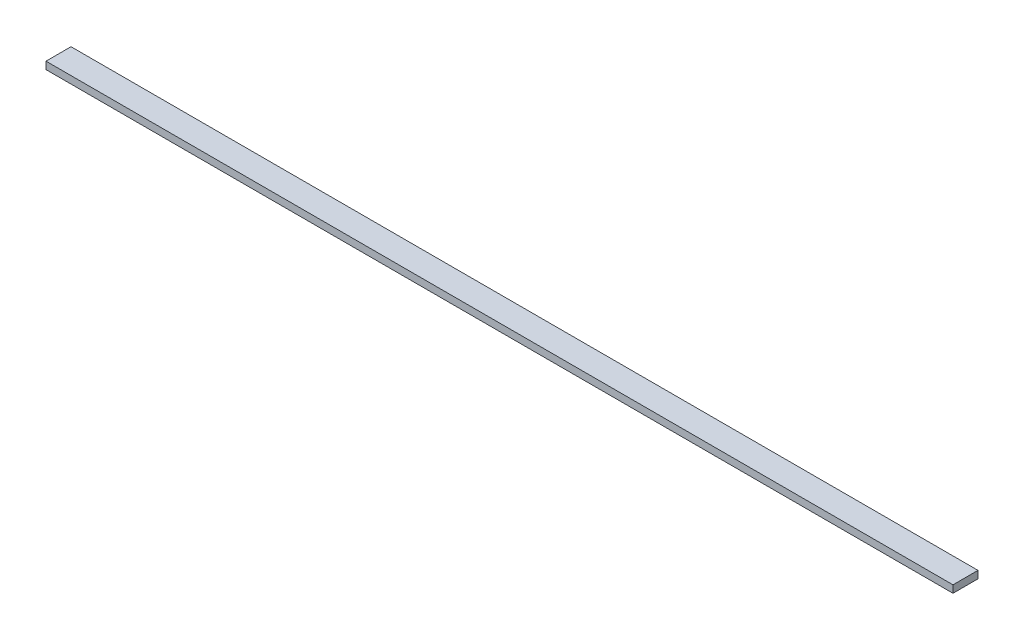
ISO-10303-21;
HEADER;
FILE_DESCRIPTION(('STEP AP214'),'2;1');
FILE_NAME('part.step','',(''),(''),'','','');
FILE_SCHEMA(('AUTOMOTIVE_DESIGN { 1 0 10303 214 1 1 1 1 }'));
ENDSEC;
DATA;
#1=APPLICATION_CONTEXT('core data for automotive mechanical design processes');
#2=APPLICATION_PROTOCOL_DEFINITION('international standard','automotive_design',2000,#1);
#3=PRODUCT_CONTEXT('',#1,'mechanical');
#4=PRODUCT('Part','Part','',(#3));
#5=PRODUCT_RELATED_PRODUCT_CATEGORY('part','',(#4));
#6=PRODUCT_DEFINITION_FORMATION('','',#4);
#7=PRODUCT_DEFINITION_CONTEXT('part definition',#1,'design');
#8=PRODUCT_DEFINITION('design','',#6,#7);
#9=PRODUCT_DEFINITION_SHAPE('','',#8);
#10=(LENGTH_UNIT() NAMED_UNIT(*) SI_UNIT(.MILLI.,.METRE.));
#11=(NAMED_UNIT(*) PLANE_ANGLE_UNIT() SI_UNIT($,.RADIAN.));
#12=(NAMED_UNIT(*) SI_UNIT($,.STERADIAN.) SOLID_ANGLE_UNIT());
#13=UNCERTAINTY_MEASURE_WITH_UNIT(LENGTH_MEASURE(1.E-05),#10,'distance_accuracy_value','');
#14=(GEOMETRIC_REPRESENTATION_CONTEXT(3) GLOBAL_UNCERTAINTY_ASSIGNED_CONTEXT((#13)) GLOBAL_UNIT_ASSIGNED_CONTEXT((#10,
#11,#12)) REPRESENTATION_CONTEXT('',''));
#15=CARTESIAN_POINT('',(0.,0.,0.));
#16=DIRECTION('',(0.,0.,1.));
#17=DIRECTION('',(1.,0.,0.));
#18=AXIS2_PLACEMENT_3D('',#15,#16,#17);
#19=CARTESIAN_POINT('',(-61.625,0.5,-1.7));
#20=DIRECTION('',(1.,0.,0.));
#21=DIRECTION('',(0.,0.,-1.));
#22=AXIS2_PLACEMENT_3D('',#19,#20,#21);
#23=PLANE('',#22);
#24=DIRECTION('',(0.,0.,1.));
#25=VECTOR('',#24,1.);
#26=CARTESIAN_POINT('',(-61.625,-0.5,-1.7));
#27=LINE('',#26,#25);
#28=CARTESIAN_POINT('',(-61.625,-0.5,-1.7));
#29=VERTEX_POINT('',#28);
#30=CARTESIAN_POINT('',(-61.625,-0.5,1.7));
#31=VERTEX_POINT('',#30);
#32=EDGE_CURVE('E98',#29,#31,#27,.T.);
#33=ORIENTED_EDGE('',*,*,#32,.T.);
#34=DIRECTION('',(0.,-1.,0.));
#35=VECTOR('',#34,1.);
#36=CARTESIAN_POINT('',(-61.625,0.5,1.7));
#37=LINE('',#36,#35);
#38=CARTESIAN_POINT('',(-61.625,0.5,1.7));
#39=VERTEX_POINT('',#38);
#40=EDGE_CURVE('E11',#39,#31,#37,.T.);
#41=ORIENTED_EDGE('',*,*,#40,.F.);
#42=DIRECTION('',(0.,0.,1.));
#43=VECTOR('',#42,1.);
#44=CARTESIAN_POINT('',(-61.625,0.5,-1.7));
#45=LINE('',#44,#43);
#46=CARTESIAN_POINT('',(-61.625,0.5,-1.7));
#47=VERTEX_POINT('',#46);
#48=EDGE_CURVE('E86',#47,#39,#45,.T.);
#49=ORIENTED_EDGE('',*,*,#48,.F.);
#50=DIRECTION('',(0.,-1.,0.));
#51=VECTOR('',#50,1.);
#52=CARTESIAN_POINT('',(-61.625,0.5,-1.7));
#53=LINE('',#52,#51);
#54=EDGE_CURVE('E94',#47,#29,#53,.T.);
#55=ORIENTED_EDGE('',*,*,#54,.T.);
#56=EDGE_LOOP('',(#33,#41,#49,#55));
#57=FACE_BOUND('',#56,.T.);
#58=ADVANCED_FACE('F35',(#57),#23,.F.);
#59=CARTESIAN_POINT('',(-61.625,0.5,1.7));
#60=DIRECTION('',(0.,0.,-1.));
#61=DIRECTION('',(-1.,0.,0.));
#62=AXIS2_PLACEMENT_3D('',#59,#60,#61);
#63=PLANE('',#62);
#64=DIRECTION('',(1.,0.,0.));
#65=VECTOR('',#64,1.);
#66=CARTESIAN_POINT('',(-61.625,-0.5,1.7));
#67=LINE('',#66,#65);
#68=CARTESIAN_POINT('',(61.625,-0.5,1.7));
#69=VERTEX_POINT('',#68);
#70=EDGE_CURVE('E90',#31,#69,#67,.T.);
#71=ORIENTED_EDGE('',*,*,#70,.T.);
#72=DIRECTION('',(0.,-1.,0.));
#73=VECTOR('',#72,1.);
#74=CARTESIAN_POINT('',(61.625,0.5,1.7));
#75=LINE('',#74,#73);
#76=CARTESIAN_POINT('',(61.625,0.5,1.7));
#77=VERTEX_POINT('',#76);
#78=EDGE_CURVE('E43',#77,#69,#75,.T.);
#79=ORIENTED_EDGE('',*,*,#78,.F.);
#80=DIRECTION('',(1.,0.,0.));
#81=VECTOR('',#80,1.);
#82=CARTESIAN_POINT('',(-61.625,0.5,1.7));
#83=LINE('',#82,#81);
#84=EDGE_CURVE('E81',#39,#77,#83,.T.);
#85=ORIENTED_EDGE('',*,*,#84,.F.);
#86=ORIENTED_EDGE('',*,*,#40,.T.);
#87=EDGE_LOOP('',(#71,#79,#85,#86));
#88=FACE_BOUND('',#87,.T.);
#89=ADVANCED_FACE('F89',(#88),#63,.F.);
#90=CARTESIAN_POINT('',(61.625,0.5,-1.7));
#91=DIRECTION('',(-1.,0.,0.));
#92=DIRECTION('',(0.,0.,1.));
#93=AXIS2_PLACEMENT_3D('',#90,#91,#92);
#94=PLANE('',#93);
#95=DIRECTION('',(0.,0.,-1.));
#96=VECTOR('',#95,1.);
#97=CARTESIAN_POINT('',(61.625,-0.5,-1.7));
#98=LINE('',#97,#96);
#99=CARTESIAN_POINT('',(61.625,-0.5,-1.7));
#100=VERTEX_POINT('',#99);
#101=EDGE_CURVE('E68',#69,#100,#98,.T.);
#102=ORIENTED_EDGE('',*,*,#101,.T.);
#103=DIRECTION('',(0.,-1.,0.));
#104=VECTOR('',#103,1.);
#105=CARTESIAN_POINT('',(61.625,0.5,-1.7));
#106=LINE('',#105,#104);
#107=CARTESIAN_POINT('',(61.625,0.5,-1.7));
#108=VERTEX_POINT('',#107);
#109=EDGE_CURVE('E91',#108,#100,#106,.T.);
#110=ORIENTED_EDGE('',*,*,#109,.F.);
#111=DIRECTION('',(0.,0.,-1.));
#112=VECTOR('',#111,1.);
#113=CARTESIAN_POINT('',(61.625,0.5,-1.7));
#114=LINE('',#113,#112);
#115=EDGE_CURVE('E84',#77,#108,#114,.T.);
#116=ORIENTED_EDGE('',*,*,#115,.F.);
#117=ORIENTED_EDGE('',*,*,#78,.T.);
#118=EDGE_LOOP('',(#102,#110,#116,#117));
#119=FACE_BOUND('',#118,.T.);
#120=ADVANCED_FACE('F92',(#119),#94,.F.);
#121=CARTESIAN_POINT('',(-61.625,0.5,-1.7));
#122=DIRECTION('',(0.,0.,1.));
#123=DIRECTION('',(1.,0.,0.));
#124=AXIS2_PLACEMENT_3D('',#121,#122,#123);
#125=PLANE('',#124);
#126=DIRECTION('',(-1.,0.,0.));
#127=VECTOR('',#126,1.);
#128=CARTESIAN_POINT('',(-61.625,-0.5,-1.7));
#129=LINE('',#128,#127);
#130=EDGE_CURVE('E74',#100,#29,#129,.T.);
#131=ORIENTED_EDGE('',*,*,#130,.T.);
#132=ORIENTED_EDGE('',*,*,#54,.F.);
#133=DIRECTION('',(-1.,0.,0.));
#134=VECTOR('',#133,1.);
#135=CARTESIAN_POINT('',(-61.625,0.5,-1.7));
#136=LINE('',#135,#134);
#137=EDGE_CURVE('E51',#108,#47,#136,.T.);
#138=ORIENTED_EDGE('',*,*,#137,.F.);
#139=ORIENTED_EDGE('',*,*,#109,.T.);
#140=EDGE_LOOP('',(#131,#132,#138,#139));
#141=FACE_BOUND('',#140,.T.);
#142=ADVANCED_FACE('F105',(#141),#125,.F.);
#143=CARTESIAN_POINT('',(0.,0.5,0.));
#144=DIRECTION('',(0.,1.,0.));
#145=DIRECTION('',(0.,0.,1.));
#146=AXIS2_PLACEMENT_3D('',#143,#144,#145);
#147=PLANE('',#146);
#148=ORIENTED_EDGE('',*,*,#48,.T.);
#149=ORIENTED_EDGE('',*,*,#84,.T.);
#150=ORIENTED_EDGE('',*,*,#115,.T.);
#151=ORIENTED_EDGE('',*,*,#137,.T.);
#152=EDGE_LOOP('',(#148,#149,#150,#151));
#153=FACE_BOUND('',#152,.T.);
#154=ADVANCED_FACE('F82',(#153),#147,.T.);
#155=CARTESIAN_POINT('',(0.,-0.5,0.));
#156=DIRECTION('',(0.,1.,0.));
#157=DIRECTION('',(0.,0.,1.));
#158=AXIS2_PLACEMENT_3D('',#155,#156,#157);
#159=PLANE('',#158);
#160=ORIENTED_EDGE('',*,*,#32,.F.);
#161=ORIENTED_EDGE('',*,*,#130,.F.);
#162=ORIENTED_EDGE('',*,*,#101,.F.);
#163=ORIENTED_EDGE('',*,*,#70,.F.);
#164=EDGE_LOOP('',(#160,#161,#162,#163));
#165=FACE_BOUND('',#164,.T.);
#166=ADVANCED_FACE('F108',(#165),#159,.F.);
#167=CLOSED_SHELL('',(#58,#89,#120,#142,#154,#166));
#168=MANIFOLD_SOLID_BREP('B2',#167);
#169=ADVANCED_BREP_SHAPE_REPRESENTATION('',(#18,#168),#14);
#170=SHAPE_DEFINITION_REPRESENTATION(#9,#169);
ENDSEC;
END-ISO-10303-21;
